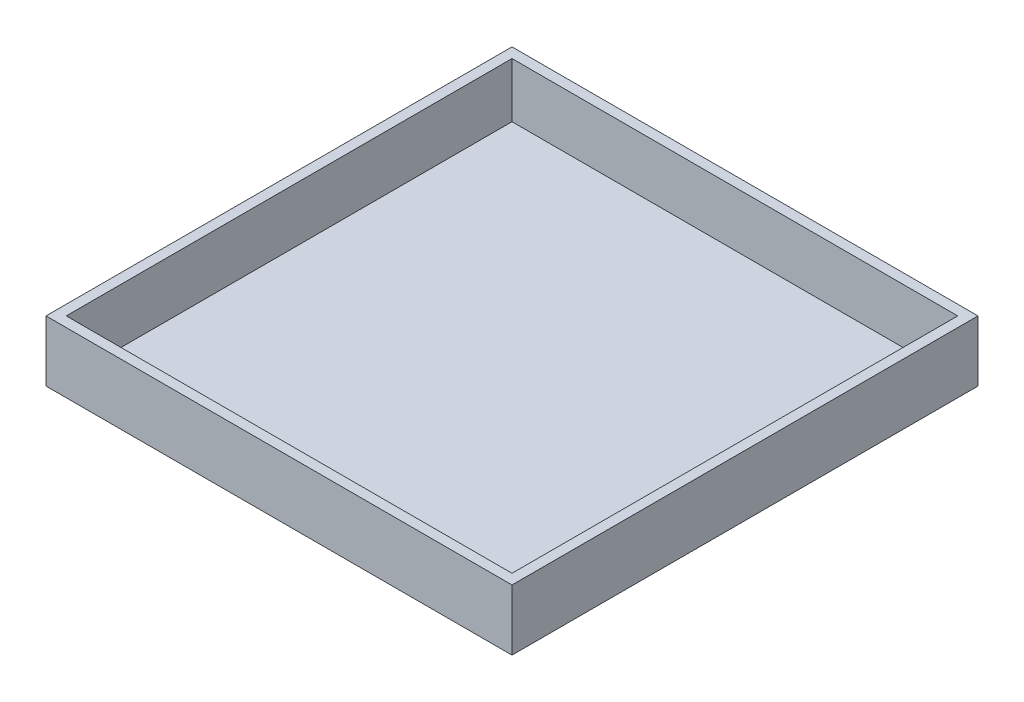
ISO-10303-21;
HEADER;
FILE_DESCRIPTION(('STEP AP214'),'2;1');
FILE_NAME('part.step','',(''),(''),'','','');
FILE_SCHEMA(('AUTOMOTIVE_DESIGN { 1 0 10303 214 1 1 1 1 }'));
ENDSEC;
DATA;
#1=APPLICATION_CONTEXT('core data for automotive mechanical design processes');
#2=APPLICATION_PROTOCOL_DEFINITION('international standard','automotive_design',2000,#1);
#3=PRODUCT_CONTEXT('',#1,'mechanical');
#4=PRODUCT('Part','Part','',(#3));
#5=PRODUCT_RELATED_PRODUCT_CATEGORY('part','',(#4));
#6=PRODUCT_DEFINITION_FORMATION('','',#4);
#7=PRODUCT_DEFINITION_CONTEXT('part definition',#1,'design');
#8=PRODUCT_DEFINITION('design','',#6,#7);
#9=PRODUCT_DEFINITION_SHAPE('','',#8);
#10=(LENGTH_UNIT() NAMED_UNIT(*) SI_UNIT(.MILLI.,.METRE.));
#11=(NAMED_UNIT(*) PLANE_ANGLE_UNIT() SI_UNIT($,.RADIAN.));
#12=(NAMED_UNIT(*) SI_UNIT($,.STERADIAN.) SOLID_ANGLE_UNIT());
#13=UNCERTAINTY_MEASURE_WITH_UNIT(LENGTH_MEASURE(1.E-05),#10,'distance_accuracy_value','');
#14=(GEOMETRIC_REPRESENTATION_CONTEXT(3) GLOBAL_UNCERTAINTY_ASSIGNED_CONTEXT((#13)) GLOBAL_UNIT_ASSIGNED_CONTEXT((#10,
#11,#12)) REPRESENTATION_CONTEXT('',''));
#15=CARTESIAN_POINT('',(0.,0.,0.));
#16=DIRECTION('',(0.,0.,1.));
#17=DIRECTION('',(1.,0.,0.));
#18=AXIS2_PLACEMENT_3D('',#15,#16,#17);
#19=CARTESIAN_POINT('',(0.,3.,0.));
#20=DIRECTION('',(0.,-1.,0.));
#21=DIRECTION('',(0.,0.,-1.));
#22=AXIS2_PLACEMENT_3D('',#19,#20,#21);
#23=PLANE('',#22);
#24=DIRECTION('',(0.,0.,-1.));
#25=VECTOR('',#24,1.);
#26=CARTESIAN_POINT('',(110.,3.,110.));
#27=LINE('',#26,#25);
#28=CARTESIAN_POINT('',(110.,3.,110.));
#29=VERTEX_POINT('',#28);
#30=CARTESIAN_POINT('',(110.,3.,-110.));
#31=VERTEX_POINT('',#30);
#32=EDGE_CURVE('E157',#29,#31,#27,.T.);
#33=ORIENTED_EDGE('',*,*,#32,.T.);
#34=DIRECTION('',(-1.,0.,0.));
#35=VECTOR('',#34,1.);
#36=CARTESIAN_POINT('',(-110.,3.,-110.));
#37=LINE('',#36,#35);
#38=CARTESIAN_POINT('',(-110.,3.,-110.));
#39=VERTEX_POINT('',#38);
#40=EDGE_CURVE('E57',#31,#39,#37,.T.);
#41=ORIENTED_EDGE('',*,*,#40,.T.);
#42=DIRECTION('',(0.,0.,1.));
#43=VECTOR('',#42,1.);
#44=CARTESIAN_POINT('',(-110.,3.,110.));
#45=LINE('',#44,#43);
#46=CARTESIAN_POINT('',(-110.,3.,110.));
#47=VERTEX_POINT('',#46);
#48=EDGE_CURVE('E42',#39,#47,#45,.T.);
#49=ORIENTED_EDGE('',*,*,#48,.T.);
#50=DIRECTION('',(1.,0.,0.));
#51=VECTOR('',#50,1.);
#52=CARTESIAN_POINT('',(-110.,3.,110.));
#53=LINE('',#52,#51);
#54=EDGE_CURVE('E11',#47,#29,#53,.T.);
#55=ORIENTED_EDGE('',*,*,#54,.T.);
#56=EDGE_LOOP('',(#33,#41,#49,#55));
#57=FACE_BOUND('',#56,.T.);
#58=ADVANCED_FACE('F34',(#57),#23,.F.);
#59=CARTESIAN_POINT('',(110.,30.,110.));
#60=DIRECTION('',(-1.,0.,0.));
#61=DIRECTION('',(0.,0.,1.));
#62=AXIS2_PLACEMENT_3D('',#59,#60,#61);
#63=PLANE('',#62);
#64=ORIENTED_EDGE('',*,*,#32,.F.);
#65=DIRECTION('',(0.,-1.,0.));
#66=VECTOR('',#65,1.);
#67=CARTESIAN_POINT('',(110.,30.,110.));
#68=LINE('',#67,#66);
#69=CARTESIAN_POINT('',(110.,30.,110.));
#70=VERTEX_POINT('',#69);
#71=EDGE_CURVE('E49',#70,#29,#68,.T.);
#72=ORIENTED_EDGE('',*,*,#71,.F.);
#73=DIRECTION('',(0.,0.,-1.));
#74=VECTOR('',#73,1.);
#75=CARTESIAN_POINT('',(110.,30.,110.));
#76=LINE('',#75,#74);
#77=CARTESIAN_POINT('',(110.,30.,-110.));
#78=VERTEX_POINT('',#77);
#79=EDGE_CURVE('E100',#70,#78,#76,.T.);
#80=ORIENTED_EDGE('',*,*,#79,.T.);
#81=DIRECTION('',(0.,-1.,0.));
#82=VECTOR('',#81,1.);
#83=CARTESIAN_POINT('',(110.,30.,-110.));
#84=LINE('',#83,#82);
#85=EDGE_CURVE('E102',#78,#31,#84,.T.);
#86=ORIENTED_EDGE('',*,*,#85,.T.);
#87=EDGE_LOOP('',(#64,#72,#80,#86));
#88=FACE_BOUND('',#87,.T.);
#89=ADVANCED_FACE('F101',(#88),#63,.T.);
#90=CARTESIAN_POINT('',(-110.,30.,-110.));
#91=DIRECTION('',(0.,0.,1.));
#92=DIRECTION('',(1.,0.,0.));
#93=AXIS2_PLACEMENT_3D('',#90,#91,#92);
#94=PLANE('',#93);
#95=ORIENTED_EDGE('',*,*,#40,.F.);
#96=ORIENTED_EDGE('',*,*,#85,.F.);
#97=DIRECTION('',(-1.,0.,0.));
#98=VECTOR('',#97,1.);
#99=CARTESIAN_POINT('',(-110.,30.,-110.));
#100=LINE('',#99,#98);
#101=CARTESIAN_POINT('',(-110.,30.,-110.));
#102=VERTEX_POINT('',#101);
#103=EDGE_CURVE('E107',#78,#102,#100,.T.);
#104=ORIENTED_EDGE('',*,*,#103,.T.);
#105=DIRECTION('',(0.,-1.,0.));
#106=VECTOR('',#105,1.);
#107=CARTESIAN_POINT('',(-110.,30.,-110.));
#108=LINE('',#107,#106);
#109=EDGE_CURVE('E112',#102,#39,#108,.T.);
#110=ORIENTED_EDGE('',*,*,#109,.T.);
#111=EDGE_LOOP('',(#95,#96,#104,#110));
#112=FACE_BOUND('',#111,.T.);
#113=ADVANCED_FACE('F109',(#112),#94,.T.);
#114=CARTESIAN_POINT('',(-110.,30.,110.));
#115=DIRECTION('',(1.,0.,0.));
#116=DIRECTION('',(0.,0.,-1.));
#117=AXIS2_PLACEMENT_3D('',#114,#115,#116);
#118=PLANE('',#117);
#119=ORIENTED_EDGE('',*,*,#48,.F.);
#120=ORIENTED_EDGE('',*,*,#109,.F.);
#121=DIRECTION('',(0.,0.,1.));
#122=VECTOR('',#121,1.);
#123=CARTESIAN_POINT('',(-110.,30.,110.));
#124=LINE('',#123,#122);
#125=CARTESIAN_POINT('',(-110.,30.,110.));
#126=VERTEX_POINT('',#125);
#127=EDGE_CURVE('E117',#102,#126,#124,.T.);
#128=ORIENTED_EDGE('',*,*,#127,.T.);
#129=DIRECTION('',(0.,-1.,0.));
#130=VECTOR('',#129,1.);
#131=CARTESIAN_POINT('',(-110.,30.,110.));
#132=LINE('',#131,#130);
#133=EDGE_CURVE('E124',#126,#47,#132,.T.);
#134=ORIENTED_EDGE('',*,*,#133,.T.);
#135=EDGE_LOOP('',(#119,#120,#128,#134));
#136=FACE_BOUND('',#135,.T.);
#137=ADVANCED_FACE('F162',(#136),#118,.T.);
#138=CARTESIAN_POINT('',(-110.,30.,110.));
#139=DIRECTION('',(0.,0.,-1.));
#140=DIRECTION('',(-1.,0.,0.));
#141=AXIS2_PLACEMENT_3D('',#138,#139,#140);
#142=PLANE('',#141);
#143=ORIENTED_EDGE('',*,*,#54,.F.);
#144=ORIENTED_EDGE('',*,*,#133,.F.);
#145=DIRECTION('',(1.,0.,0.));
#146=VECTOR('',#145,1.);
#147=CARTESIAN_POINT('',(-110.,30.,110.));
#148=LINE('',#147,#146);
#149=EDGE_CURVE('E119',#126,#70,#148,.T.);
#150=ORIENTED_EDGE('',*,*,#149,.T.);
#151=ORIENTED_EDGE('',*,*,#71,.T.);
#152=EDGE_LOOP('',(#143,#144,#150,#151));
#153=FACE_BOUND('',#152,.T.);
#154=ADVANCED_FACE('F163',(#153),#142,.T.);
#155=CARTESIAN_POINT('',(0.,30.,0.));
#156=DIRECTION('',(0.,-1.,0.));
#157=DIRECTION('',(0.,0.,-1.));
#158=AXIS2_PLACEMENT_3D('',#155,#156,#157);
#159=PLANE('',#158);
#160=DIRECTION('',(0.,0.,-1.));
#161=VECTOR('',#160,1.);
#162=CARTESIAN_POINT('',(115.,30.,115.));
#163=LINE('',#162,#161);
#164=CARTESIAN_POINT('',(115.,30.,115.));
#165=VERTEX_POINT('',#164);
#166=CARTESIAN_POINT('',(115.,30.,-115.));
#167=VERTEX_POINT('',#166);
#168=EDGE_CURVE('E128',#165,#167,#163,.T.);
#169=ORIENTED_EDGE('',*,*,#168,.T.);
#170=DIRECTION('',(-1.,0.,0.));
#171=VECTOR('',#170,1.);
#172=CARTESIAN_POINT('',(-115.,30.,-115.));
#173=LINE('',#172,#171);
#174=CARTESIAN_POINT('',(-115.,30.,-115.));
#175=VERTEX_POINT('',#174);
#176=EDGE_CURVE('E131',#167,#175,#173,.T.);
#177=ORIENTED_EDGE('',*,*,#176,.T.);
#178=DIRECTION('',(0.,0.,1.));
#179=VECTOR('',#178,1.);
#180=CARTESIAN_POINT('',(-115.,30.,115.));
#181=LINE('',#180,#179);
#182=CARTESIAN_POINT('',(-115.,30.,115.));
#183=VERTEX_POINT('',#182);
#184=EDGE_CURVE('E134',#175,#183,#181,.T.);
#185=ORIENTED_EDGE('',*,*,#184,.T.);
#186=DIRECTION('',(1.,0.,0.));
#187=VECTOR('',#186,1.);
#188=CARTESIAN_POINT('',(-115.,30.,115.));
#189=LINE('',#188,#187);
#190=EDGE_CURVE('E136',#183,#165,#189,.T.);
#191=ORIENTED_EDGE('',*,*,#190,.T.);
#192=EDGE_LOOP('',(#169,#177,#185,#191));
#193=FACE_BOUND('',#192,.T.);
#194=ORIENTED_EDGE('',*,*,#79,.F.);
#195=ORIENTED_EDGE('',*,*,#149,.F.);
#196=ORIENTED_EDGE('',*,*,#127,.F.);
#197=ORIENTED_EDGE('',*,*,#103,.F.);
#198=EDGE_LOOP('',(#194,#195,#196,#197));
#199=FACE_BOUND('',#198,.T.);
#200=ADVANCED_FACE('F115',(#193,#199),#159,.F.);
#201=CARTESIAN_POINT('',(115.,30.,115.));
#202=DIRECTION('',(-1.,0.,0.));
#203=DIRECTION('',(0.,0.,1.));
#204=AXIS2_PLACEMENT_3D('',#201,#202,#203);
#205=PLANE('',#204);
#206=DIRECTION('',(0.,0.,-1.));
#207=VECTOR('',#206,1.);
#208=CARTESIAN_POINT('',(115.,0.,115.));
#209=LINE('',#208,#207);
#210=CARTESIAN_POINT('',(115.,0.,115.));
#211=VERTEX_POINT('',#210);
#212=CARTESIAN_POINT('',(115.,0.,-115.));
#213=VERTEX_POINT('',#212);
#214=EDGE_CURVE('E111',#211,#213,#209,.T.);
#215=ORIENTED_EDGE('',*,*,#214,.T.);
#216=DIRECTION('',(0.,-1.,0.));
#217=VECTOR('',#216,1.);
#218=CARTESIAN_POINT('',(115.,30.,-115.));
#219=LINE('',#218,#217);
#220=EDGE_CURVE('E154',#167,#213,#219,.T.);
#221=ORIENTED_EDGE('',*,*,#220,.F.);
#222=ORIENTED_EDGE('',*,*,#168,.F.);
#223=DIRECTION('',(0.,-1.,0.));
#224=VECTOR('',#223,1.);
#225=CARTESIAN_POINT('',(115.,30.,115.));
#226=LINE('',#225,#224);
#227=EDGE_CURVE('E138',#165,#211,#226,.T.);
#228=ORIENTED_EDGE('',*,*,#227,.T.);
#229=EDGE_LOOP('',(#215,#221,#222,#228));
#230=FACE_BOUND('',#229,.T.);
#231=ADVANCED_FACE('F170',(#230),#205,.F.);
#232=CARTESIAN_POINT('',(-115.,30.,-115.));
#233=DIRECTION('',(0.,0.,1.));
#234=DIRECTION('',(1.,0.,0.));
#235=AXIS2_PLACEMENT_3D('',#232,#233,#234);
#236=PLANE('',#235);
#237=DIRECTION('',(-1.,0.,0.));
#238=VECTOR('',#237,1.);
#239=CARTESIAN_POINT('',(-115.,0.,-115.));
#240=LINE('',#239,#238);
#241=CARTESIAN_POINT('',(-115.,0.,-115.));
#242=VERTEX_POINT('',#241);
#243=EDGE_CURVE('E141',#213,#242,#240,.T.);
#244=ORIENTED_EDGE('',*,*,#243,.T.);
#245=DIRECTION('',(0.,-1.,0.));
#246=VECTOR('',#245,1.);
#247=CARTESIAN_POINT('',(-115.,30.,-115.));
#248=LINE('',#247,#246);
#249=EDGE_CURVE('E151',#175,#242,#248,.T.);
#250=ORIENTED_EDGE('',*,*,#249,.F.);
#251=ORIENTED_EDGE('',*,*,#176,.F.);
#252=ORIENTED_EDGE('',*,*,#220,.T.);
#253=EDGE_LOOP('',(#244,#250,#251,#252));
#254=FACE_BOUND('',#253,.T.);
#255=ADVANCED_FACE('F182',(#254),#236,.F.);
#256=CARTESIAN_POINT('',(-115.,30.,115.));
#257=DIRECTION('',(1.,0.,0.));
#258=DIRECTION('',(0.,0.,-1.));
#259=AXIS2_PLACEMENT_3D('',#256,#257,#258);
#260=PLANE('',#259);
#261=DIRECTION('',(0.,0.,1.));
#262=VECTOR('',#261,1.);
#263=CARTESIAN_POINT('',(-115.,0.,115.));
#264=LINE('',#263,#262);
#265=CARTESIAN_POINT('',(-115.,0.,115.));
#266=VERTEX_POINT('',#265);
#267=EDGE_CURVE('E143',#242,#266,#264,.T.);
#268=ORIENTED_EDGE('',*,*,#267,.T.);
#269=DIRECTION('',(0.,-1.,0.));
#270=VECTOR('',#269,1.);
#271=CARTESIAN_POINT('',(-115.,30.,115.));
#272=LINE('',#271,#270);
#273=EDGE_CURVE('E148',#183,#266,#272,.T.);
#274=ORIENTED_EDGE('',*,*,#273,.F.);
#275=ORIENTED_EDGE('',*,*,#184,.F.);
#276=ORIENTED_EDGE('',*,*,#249,.T.);
#277=EDGE_LOOP('',(#268,#274,#275,#276));
#278=FACE_BOUND('',#277,.T.);
#279=ADVANCED_FACE('F186',(#278),#260,.F.);
#280=CARTESIAN_POINT('',(-115.,30.,115.));
#281=DIRECTION('',(0.,0.,-1.));
#282=DIRECTION('',(-1.,0.,0.));
#283=AXIS2_PLACEMENT_3D('',#280,#281,#282);
#284=PLANE('',#283);
#285=DIRECTION('',(1.,0.,0.));
#286=VECTOR('',#285,1.);
#287=CARTESIAN_POINT('',(-115.,0.,115.));
#288=LINE('',#287,#286);
#289=EDGE_CURVE('E132',#266,#211,#288,.T.);
#290=ORIENTED_EDGE('',*,*,#289,.T.);
#291=ORIENTED_EDGE('',*,*,#227,.F.);
#292=ORIENTED_EDGE('',*,*,#190,.F.);
#293=ORIENTED_EDGE('',*,*,#273,.T.);
#294=EDGE_LOOP('',(#290,#291,#292,#293));
#295=FACE_BOUND('',#294,.T.);
#296=ADVANCED_FACE('F190',(#295),#284,.F.);
#297=CARTESIAN_POINT('',(0.,0.,0.));
#298=DIRECTION('',(0.,-1.,0.));
#299=DIRECTION('',(0.,0.,-1.));
#300=AXIS2_PLACEMENT_3D('',#297,#298,#299);
#301=PLANE('',#300);
#302=ORIENTED_EDGE('',*,*,#214,.F.);
#303=ORIENTED_EDGE('',*,*,#289,.F.);
#304=ORIENTED_EDGE('',*,*,#267,.F.);
#305=ORIENTED_EDGE('',*,*,#243,.F.);
#306=EDGE_LOOP('',(#302,#303,#304,#305));
#307=FACE_BOUND('',#306,.T.);
#308=ADVANCED_FACE('F36',(#307),#301,.T.);
#309=CLOSED_SHELL('',(#58,#89,#113,#137,#154,#200,#231,#255,#279,#296,#308));
#310=MANIFOLD_SOLID_BREP('B2',#309);
#311=ADVANCED_BREP_SHAPE_REPRESENTATION('',(#18,#310),#14);
#312=SHAPE_DEFINITION_REPRESENTATION(#9,#311);
ENDSEC;
END-ISO-10303-21;
